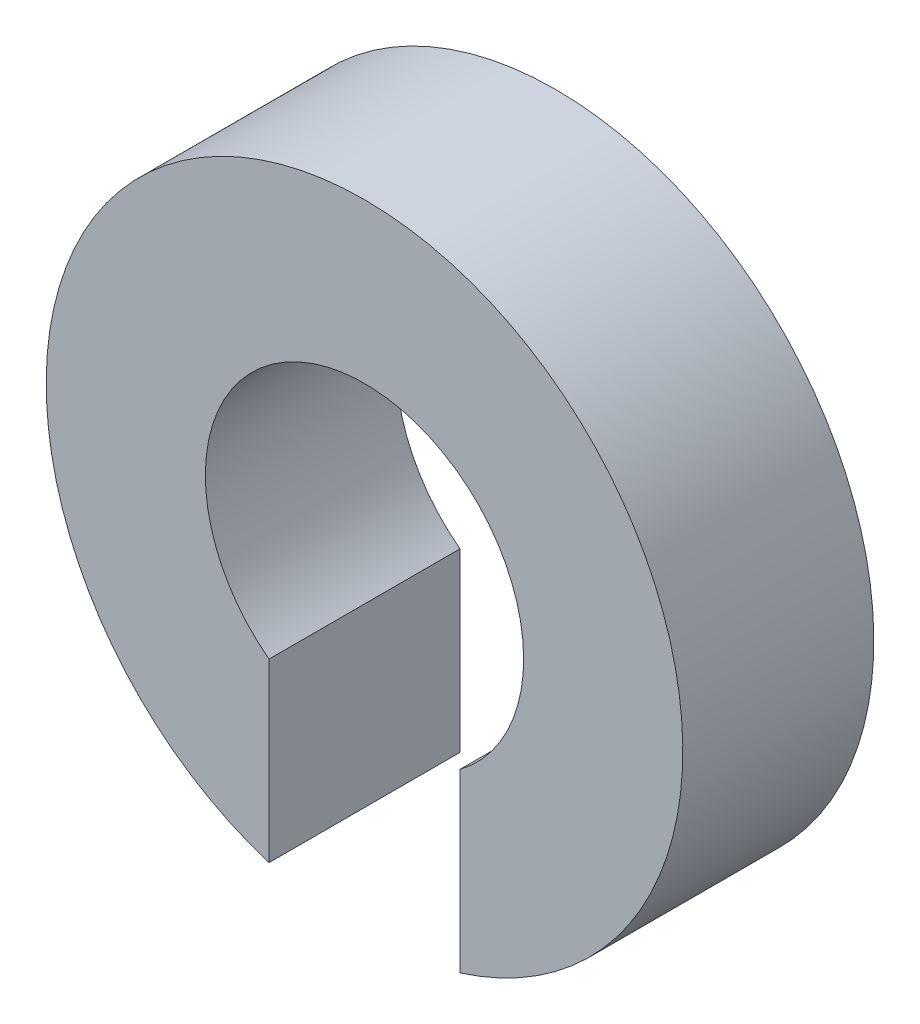
ISO-10303-21;
HEADER;
FILE_DESCRIPTION(('STEP AP214'),'2;1');
FILE_NAME('part.step','',(''),(''),'','','');
FILE_SCHEMA(('AUTOMOTIVE_DESIGN { 1 0 10303 214 1 1 1 1 }'));
ENDSEC;
DATA;
#1=APPLICATION_CONTEXT('core data for automotive mechanical design processes');
#2=APPLICATION_PROTOCOL_DEFINITION('international standard','automotive_design',2000,#1);
#3=PRODUCT_CONTEXT('',#1,'mechanical');
#4=PRODUCT('Part','Part','',(#3));
#5=PRODUCT_RELATED_PRODUCT_CATEGORY('part','',(#4));
#6=PRODUCT_DEFINITION_FORMATION('','',#4);
#7=PRODUCT_DEFINITION_CONTEXT('part definition',#1,'design');
#8=PRODUCT_DEFINITION('design','',#6,#7);
#9=PRODUCT_DEFINITION_SHAPE('','',#8);
#10=(LENGTH_UNIT() NAMED_UNIT(*) SI_UNIT(.MILLI.,.METRE.));
#11=(NAMED_UNIT(*) PLANE_ANGLE_UNIT() SI_UNIT($,.RADIAN.));
#12=(NAMED_UNIT(*) SI_UNIT($,.STERADIAN.) SOLID_ANGLE_UNIT());
#13=UNCERTAINTY_MEASURE_WITH_UNIT(LENGTH_MEASURE(1.E-05),#10,'distance_accuracy_value','');
#14=(GEOMETRIC_REPRESENTATION_CONTEXT(3) GLOBAL_UNCERTAINTY_ASSIGNED_CONTEXT((#13)) GLOBAL_UNIT_ASSIGNED_CONTEXT((#10,
#11,#12)) REPRESENTATION_CONTEXT('',''));
#15=CARTESIAN_POINT('',(0.,0.,0.));
#16=DIRECTION('',(0.,0.,1.));
#17=DIRECTION('',(1.,0.,0.));
#18=AXIS2_PLACEMENT_3D('',#15,#16,#17);
#19=CARTESIAN_POINT('',(0.,0.,3.));
#20=DIRECTION('',(0.,0.,-1.));
#21=DIRECTION('',(-1.,0.,0.));
#22=AXIS2_PLACEMENT_3D('',#19,#20,#21);
#23=CYLINDRICAL_SURFACE('',#22,5.);
#24=CARTESIAN_POINT('',(0.,0.,0.));
#25=DIRECTION('',(0.,0.,1.));
#26=DIRECTION('',(1.,0.,0.));
#27=AXIS2_PLACEMENT_3D('',#24,#25,#26);
#28=CIRCLE('',#27,5.);
#29=CARTESIAN_POINT('',(1.5,-4.76969600708473,0.));
#30=VERTEX_POINT('',#29);
#31=CARTESIAN_POINT('',(-1.5,-4.76969600708473,0.));
#32=VERTEX_POINT('',#31);
#33=EDGE_CURVE('E94',#30,#32,#28,.T.);
#34=ORIENTED_EDGE('',*,*,#33,.T.);
#35=DIRECTION('',(0.,0.,-1.));
#36=VECTOR('',#35,1.);
#37=CARTESIAN_POINT('',(-1.5,-4.76969600708473,3.));
#38=LINE('',#37,#36);
#39=CARTESIAN_POINT('',(-1.5,-4.76969600708473,3.));
#40=VERTEX_POINT('',#39);
#41=EDGE_CURVE('E11',#40,#32,#38,.T.);
#42=ORIENTED_EDGE('',*,*,#41,.F.);
#43=CARTESIAN_POINT('',(0.,0.,3.));
#44=DIRECTION('',(0.,0.,1.));
#45=DIRECTION('',(1.,0.,0.));
#46=AXIS2_PLACEMENT_3D('',#43,#44,#45);
#47=CIRCLE('',#46,5.);
#48=CARTESIAN_POINT('',(1.5,-4.76969600708473,3.));
#49=VERTEX_POINT('',#48);
#50=EDGE_CURVE('E82',#49,#40,#47,.T.);
#51=ORIENTED_EDGE('',*,*,#50,.F.);
#52=DIRECTION('',(0.,0.,-1.));
#53=VECTOR('',#52,1.);
#54=CARTESIAN_POINT('',(1.5,-4.76969600708473,3.));
#55=LINE('',#54,#53);
#56=EDGE_CURVE('E90',#49,#30,#55,.T.);
#57=ORIENTED_EDGE('',*,*,#56,.T.);
#58=EDGE_LOOP('',(#34,#42,#51,#57));
#59=FACE_BOUND('',#58,.T.);
#60=ADVANCED_FACE('F31',(#59),#23,.T.);
#61=CARTESIAN_POINT('',(-1.5,-4.76969600708473,3.));
#62=DIRECTION('',(-1.,0.,0.));
#63=DIRECTION('',(0.,-1.,0.));
#64=AXIS2_PLACEMENT_3D('',#61,#62,#63);
#65=PLANE('',#64);
#66=DIRECTION('',(0.,1.,0.));
#67=VECTOR('',#66,1.);
#68=CARTESIAN_POINT('',(-1.5,-4.76969600708473,0.));
#69=LINE('',#68,#67);
#70=CARTESIAN_POINT('',(-1.5,-2.,0.));
#71=VERTEX_POINT('',#70);
#72=EDGE_CURVE('E86',#32,#71,#69,.T.);
#73=ORIENTED_EDGE('',*,*,#72,.T.);
#74=DIRECTION('',(0.,0.,-1.));
#75=VECTOR('',#74,1.);
#76=CARTESIAN_POINT('',(-1.5,-2.,3.));
#77=LINE('',#76,#75);
#78=CARTESIAN_POINT('',(-1.5,-2.,3.));
#79=VERTEX_POINT('',#78);
#80=EDGE_CURVE('E39',#79,#71,#77,.T.);
#81=ORIENTED_EDGE('',*,*,#80,.F.);
#82=DIRECTION('',(0.,1.,0.));
#83=VECTOR('',#82,1.);
#84=CARTESIAN_POINT('',(-1.5,-4.76969600708473,3.));
#85=LINE('',#84,#83);
#86=EDGE_CURVE('E77',#40,#79,#85,.T.);
#87=ORIENTED_EDGE('',*,*,#86,.F.);
#88=ORIENTED_EDGE('',*,*,#41,.T.);
#89=EDGE_LOOP('',(#73,#81,#87,#88));
#90=FACE_BOUND('',#89,.T.);
#91=ADVANCED_FACE('F85',(#90),#65,.F.);
#92=CARTESIAN_POINT('',(0.,0.,3.));
#93=DIRECTION('',(0.,0.,-1.));
#94=DIRECTION('',(-1.,0.,0.));
#95=AXIS2_PLACEMENT_3D('',#92,#93,#94);
#96=CYLINDRICAL_SURFACE('',#95,2.5);
#97=CARTESIAN_POINT('',(0.,0.,0.));
#98=DIRECTION('',(0.,0.,-1.));
#99=DIRECTION('',(1.,0.,0.));
#100=AXIS2_PLACEMENT_3D('',#97,#98,#99);
#101=CIRCLE('',#100,2.5);
#102=CARTESIAN_POINT('',(1.5,-2.,0.));
#103=VERTEX_POINT('',#102);
#104=EDGE_CURVE('E64',#71,#103,#101,.T.);
#105=ORIENTED_EDGE('',*,*,#104,.T.);
#106=DIRECTION('',(0.,0.,-1.));
#107=VECTOR('',#106,1.);
#108=CARTESIAN_POINT('',(1.5,-2.,3.));
#109=LINE('',#108,#107);
#110=CARTESIAN_POINT('',(1.5,-2.,3.));
#111=VERTEX_POINT('',#110);
#112=EDGE_CURVE('E87',#111,#103,#109,.T.);
#113=ORIENTED_EDGE('',*,*,#112,.F.);
#114=CARTESIAN_POINT('',(0.,0.,3.));
#115=DIRECTION('',(0.,0.,-1.));
#116=DIRECTION('',(1.,0.,0.));
#117=AXIS2_PLACEMENT_3D('',#114,#115,#116);
#118=CIRCLE('',#117,2.5);
#119=EDGE_CURVE('E80',#79,#111,#118,.T.);
#120=ORIENTED_EDGE('',*,*,#119,.F.);
#121=ORIENTED_EDGE('',*,*,#80,.T.);
#122=EDGE_LOOP('',(#105,#113,#120,#121));
#123=FACE_BOUND('',#122,.T.);
#124=ADVANCED_FACE('F88',(#123),#96,.F.);
#125=CARTESIAN_POINT('',(1.5,-4.76969600708473,3.));
#126=DIRECTION('',(1.,0.,0.));
#127=DIRECTION('',(0.,1.,0.));
#128=AXIS2_PLACEMENT_3D('',#125,#126,#127);
#129=PLANE('',#128);
#130=DIRECTION('',(0.,-1.,0.));
#131=VECTOR('',#130,1.);
#132=CARTESIAN_POINT('',(1.5,-4.76969600708473,0.));
#133=LINE('',#132,#131);
#134=EDGE_CURVE('E70',#103,#30,#133,.T.);
#135=ORIENTED_EDGE('',*,*,#134,.T.);
#136=ORIENTED_EDGE('',*,*,#56,.F.);
#137=DIRECTION('',(0.,-1.,0.));
#138=VECTOR('',#137,1.);
#139=CARTESIAN_POINT('',(1.5,-4.76969600708473,3.));
#140=LINE('',#139,#138);
#141=EDGE_CURVE('E47',#111,#49,#140,.T.);
#142=ORIENTED_EDGE('',*,*,#141,.F.);
#143=ORIENTED_EDGE('',*,*,#112,.T.);
#144=EDGE_LOOP('',(#135,#136,#142,#143));
#145=FACE_BOUND('',#144,.T.);
#146=ADVANCED_FACE('F101',(#145),#129,.F.);
#147=CARTESIAN_POINT('',(0.,0.,3.));
#148=DIRECTION('',(0.,0.,1.));
#149=DIRECTION('',(1.,0.,0.));
#150=AXIS2_PLACEMENT_3D('',#147,#148,#149);
#151=PLANE('',#150);
#152=ORIENTED_EDGE('',*,*,#50,.T.);
#153=ORIENTED_EDGE('',*,*,#86,.T.);
#154=ORIENTED_EDGE('',*,*,#119,.T.);
#155=ORIENTED_EDGE('',*,*,#141,.T.);
#156=EDGE_LOOP('',(#152,#153,#154,#155));
#157=FACE_BOUND('',#156,.T.);
#158=ADVANCED_FACE('F78',(#157),#151,.T.);
#159=CARTESIAN_POINT('',(0.,0.,0.));
#160=DIRECTION('',(0.,0.,1.));
#161=DIRECTION('',(1.,0.,0.));
#162=AXIS2_PLACEMENT_3D('',#159,#160,#161);
#163=PLANE('',#162);
#164=ORIENTED_EDGE('',*,*,#33,.F.);
#165=ORIENTED_EDGE('',*,*,#134,.F.);
#166=ORIENTED_EDGE('',*,*,#104,.F.);
#167=ORIENTED_EDGE('',*,*,#72,.F.);
#168=EDGE_LOOP('',(#164,#165,#166,#167));
#169=FACE_BOUND('',#168,.T.);
#170=ADVANCED_FACE('F104',(#169),#163,.F.);
#171=CLOSED_SHELL('',(#60,#91,#124,#146,#158,#170));
#172=MANIFOLD_SOLID_BREP('B2',#171);
#173=ADVANCED_BREP_SHAPE_REPRESENTATION('',(#18,#172),#14);
#174=SHAPE_DEFINITION_REPRESENTATION(#9,#173);
ENDSEC;
END-ISO-10303-21;
